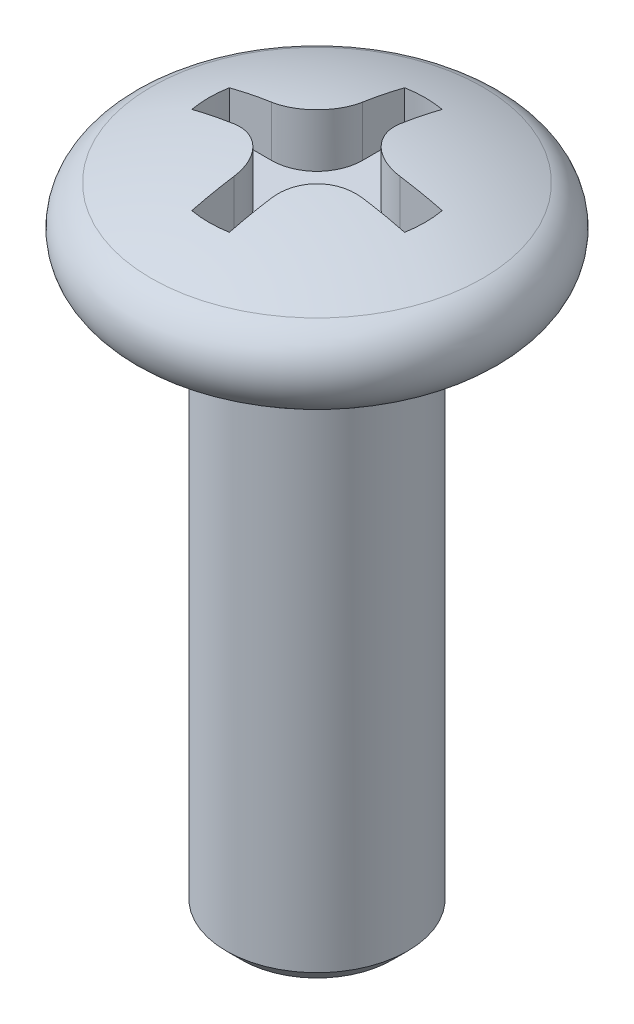
ISO-10303-21;
HEADER;
FILE_DESCRIPTION(('STEP AP214'),'2;1');
FILE_NAME('part.step','',(''),(''),'','','');
FILE_SCHEMA(('AUTOMOTIVE_DESIGN { 1 0 10303 214 1 1 1 1 }'));
ENDSEC;
DATA;
#1=APPLICATION_CONTEXT('core data for automotive mechanical design processes');
#2=APPLICATION_PROTOCOL_DEFINITION('international standard','automotive_design',2000,#1);
#3=PRODUCT_CONTEXT('',#1,'mechanical');
#4=PRODUCT('Part','Part','',(#3));
#5=PRODUCT_RELATED_PRODUCT_CATEGORY('part','',(#4));
#6=PRODUCT_DEFINITION_FORMATION('','',#4);
#7=PRODUCT_DEFINITION_CONTEXT('part definition',#1,'design');
#8=PRODUCT_DEFINITION('design','',#6,#7);
#9=PRODUCT_DEFINITION_SHAPE('','',#8);
#10=(LENGTH_UNIT() NAMED_UNIT(*) SI_UNIT(.MILLI.,.METRE.));
#11=(NAMED_UNIT(*) PLANE_ANGLE_UNIT() SI_UNIT($,.RADIAN.));
#12=(NAMED_UNIT(*) SI_UNIT($,.STERADIAN.) SOLID_ANGLE_UNIT());
#13=UNCERTAINTY_MEASURE_WITH_UNIT(LENGTH_MEASURE(1.E-05),#10,'distance_accuracy_value','');
#14=(GEOMETRIC_REPRESENTATION_CONTEXT(3) GLOBAL_UNCERTAINTY_ASSIGNED_CONTEXT((#13)) GLOBAL_UNIT_ASSIGNED_CONTEXT((#10,
#11,#12)) REPRESENTATION_CONTEXT('',''));
#15=CARTESIAN_POINT('',(0.,0.,0.));
#16=DIRECTION('',(0.,0.,1.));
#17=DIRECTION('',(1.,0.,0.));
#18=AXIS2_PLACEMENT_3D('',#15,#16,#17);
#19=CARTESIAN_POINT('',(0.,0.8,0.));
#20=DIRECTION('',(0.,-1.,0.));
#21=DIRECTION('',(0.,0.,-1.));
#22=AXIS2_PLACEMENT_3D('',#19,#20,#21);
#23=PLANE('',#22);
#24=DIRECTION('',(0.,0.,1.));
#25=VECTOR('',#24,1.);
#26=CARTESIAN_POINT('',(-0.2692388155425,0.8,1.526437178598));
#27=LINE('',#26,#25);
#28=CARTESIAN_POINT('',(-0.2692388155425,0.8,0.9192388155425));
#29=VERTEX_POINT('',#28);
#30=CARTESIAN_POINT('',(-0.2692388155425,0.8,1.52643717859784));
#31=VERTEX_POINT('',#30);
#32=EDGE_CURVE('E159',#29,#31,#27,.T.);
#33=ORIENTED_EDGE('',*,*,#32,.T.);
#34=CARTESIAN_POINT('',(0.,0.8,0.));
#35=DIRECTION('',(0.,-1.,0.));
#36=DIRECTION('',(0.,0.,-1.));
#37=AXIS2_PLACEMENT_3D('',#34,#35,#36);
#38=CIRCLE('',#37,1.55);
#39=CARTESIAN_POINT('',(0.269238815542473,0.8,1.52643717859769));
#40=VERTEX_POINT('',#39);
#41=EDGE_CURVE('E231',#31,#40,#38,.F.);
#42=ORIENTED_EDGE('',*,*,#41,.T.);
#43=DIRECTION('',(0.,0.,-1.));
#44=VECTOR('',#43,1.);
#45=CARTESIAN_POINT('',(0.2692388155425,0.8,0.9192388155425));
#46=LINE('',#45,#44);
#47=CARTESIAN_POINT('',(0.2692388155425,0.8,0.9192388155425));
#48=VERTEX_POINT('',#47);
#49=EDGE_CURVE('E163',#40,#48,#46,.T.);
#50=ORIENTED_EDGE('',*,*,#49,.T.);
#51=CARTESIAN_POINT('',(0.9192388155425,0.8,0.9192388155425));
#52=DIRECTION('',(0.,-1.,0.));
#53=DIRECTION('',(0.,0.,-1.));
#54=AXIS2_PLACEMENT_3D('',#51,#52,#53);
#55=CIRCLE('',#54,0.65);
#56=CARTESIAN_POINT('',(0.9192388155425,0.8,0.2692388155425));
#57=VERTEX_POINT('',#56);
#58=EDGE_CURVE('E166',#57,#48,#55,.F.);
#59=ORIENTED_EDGE('',*,*,#58,.F.);
#60=DIRECTION('',(1.,0.,0.));
#61=VECTOR('',#60,1.);
#62=CARTESIAN_POINT('',(1.526437178598,0.8,0.2692388155425));
#63=LINE('',#62,#61);
#64=CARTESIAN_POINT('',(1.52643717859784,0.8,0.2692388155425));
#65=VERTEX_POINT('',#64);
#66=EDGE_CURVE('E167',#57,#65,#63,.T.);
#67=ORIENTED_EDGE('',*,*,#66,.T.);
#68=CARTESIAN_POINT('',(0.,0.8,0.));
#69=DIRECTION('',(0.,-1.,0.));
#70=DIRECTION('',(0.,0.,-1.));
#71=AXIS2_PLACEMENT_3D('',#68,#69,#70);
#72=CIRCLE('',#71,1.55);
#73=CARTESIAN_POINT('',(1.52643717859769,0.8,-0.269238815542473));
#74=VERTEX_POINT('',#73);
#75=EDGE_CURVE('E242',#65,#74,#72,.F.);
#76=ORIENTED_EDGE('',*,*,#75,.T.);
#77=DIRECTION('',(-1.,0.,0.));
#78=VECTOR('',#77,1.);
#79=CARTESIAN_POINT('',(0.9192388155425,0.8,-0.2692388155425));
#80=LINE('',#79,#78);
#81=CARTESIAN_POINT('',(0.9192388155425,0.8,-0.2692388155425));
#82=VERTEX_POINT('',#81);
#83=EDGE_CURVE('E171',#74,#82,#80,.T.);
#84=ORIENTED_EDGE('',*,*,#83,.T.);
#85=CARTESIAN_POINT('',(0.9192388155425,0.8,-0.9192388155425));
#86=DIRECTION('',(0.,-1.,0.));
#87=DIRECTION('',(0.,0.,-1.));
#88=AXIS2_PLACEMENT_3D('',#85,#86,#87);
#89=CIRCLE('',#88,0.65);
#90=CARTESIAN_POINT('',(0.2692388155425,0.8,-0.9192388155425));
#91=VERTEX_POINT('',#90);
#92=EDGE_CURVE('E174',#91,#82,#89,.F.);
#93=ORIENTED_EDGE('',*,*,#92,.F.);
#94=DIRECTION('',(0.,0.,-1.));
#95=VECTOR('',#94,1.);
#96=CARTESIAN_POINT('',(0.2692388155425,0.8,-1.526437178598));
#97=LINE('',#96,#95);
#98=CARTESIAN_POINT('',(0.2692388155425,0.8,-1.52643717859784));
#99=VERTEX_POINT('',#98);
#100=EDGE_CURVE('E176',#91,#99,#97,.T.);
#101=ORIENTED_EDGE('',*,*,#100,.T.);
#102=CARTESIAN_POINT('',(0.,0.8,0.));
#103=DIRECTION('',(0.,-1.,0.));
#104=DIRECTION('',(0.,0.,-1.));
#105=AXIS2_PLACEMENT_3D('',#102,#103,#104);
#106=CIRCLE('',#105,1.55);
#107=CARTESIAN_POINT('',(-0.269238815542474,0.8,-1.52643717859769));
#108=VERTEX_POINT('',#107);
#109=EDGE_CURVE('E135',#99,#108,#106,.F.);
#110=ORIENTED_EDGE('',*,*,#109,.T.);
#111=DIRECTION('',(0.,0.,1.));
#112=VECTOR('',#111,1.);
#113=CARTESIAN_POINT('',(-0.2692388155425,0.8,-0.9192388155425));
#114=LINE('',#113,#112);
#115=CARTESIAN_POINT('',(-0.2692388155425,0.8,-0.9192388155425));
#116=VERTEX_POINT('',#115);
#117=EDGE_CURVE('E131',#108,#116,#114,.T.);
#118=ORIENTED_EDGE('',*,*,#117,.T.);
#119=CARTESIAN_POINT('',(-0.9192388155425,0.8,-0.9192388155425));
#120=DIRECTION('',(0.,-1.,0.));
#121=DIRECTION('',(0.,0.,-1.));
#122=AXIS2_PLACEMENT_3D('',#119,#120,#121);
#123=CIRCLE('',#122,0.65);
#124=CARTESIAN_POINT('',(-0.9192388155425,0.8,-0.2692388155425));
#125=VERTEX_POINT('',#124);
#126=EDGE_CURVE('E19',#125,#116,#123,.F.);
#127=ORIENTED_EDGE('',*,*,#126,.F.);
#128=DIRECTION('',(-1.,0.,0.));
#129=VECTOR('',#128,1.);
#130=CARTESIAN_POINT('',(-1.526437178598,0.8,-0.2692388155425));
#131=LINE('',#130,#129);
#132=CARTESIAN_POINT('',(-1.52643717859769,0.8,-0.269238815542473));
#133=VERTEX_POINT('',#132);
#134=EDGE_CURVE('E126',#125,#133,#131,.T.);
#135=ORIENTED_EDGE('',*,*,#134,.T.);
#136=CARTESIAN_POINT('',(0.,0.8,0.));
#137=DIRECTION('',(0.,-1.,0.));
#138=DIRECTION('',(0.,0.,-1.));
#139=AXIS2_PLACEMENT_3D('',#136,#137,#138);
#140=CIRCLE('',#139,1.55);
#141=CARTESIAN_POINT('',(-1.52643717859784,0.8,0.2692388155425));
#142=VERTEX_POINT('',#141);
#143=EDGE_CURVE('E239',#133,#142,#140,.F.);
#144=ORIENTED_EDGE('',*,*,#143,.T.);
#145=DIRECTION('',(1.,0.,0.));
#146=VECTOR('',#145,1.);
#147=CARTESIAN_POINT('',(-0.9192388155425,0.8,0.2692388155425));
#148=LINE('',#147,#146);
#149=CARTESIAN_POINT('',(-0.9192388155425,0.8,0.2692388155425));
#150=VERTEX_POINT('',#149);
#151=EDGE_CURVE('E156',#142,#150,#148,.T.);
#152=ORIENTED_EDGE('',*,*,#151,.T.);
#153=CARTESIAN_POINT('',(-0.9192388155425,0.8,0.9192388155425));
#154=DIRECTION('',(0.,-1.,0.));
#155=DIRECTION('',(0.,0.,-1.));
#156=AXIS2_PLACEMENT_3D('',#153,#154,#155);
#157=CIRCLE('',#156,0.65);
#158=EDGE_CURVE('E225',#29,#150,#157,.F.);
#159=ORIENTED_EDGE('',*,*,#158,.F.);
#160=EDGE_LOOP('',(#33,#42,#50,#59,#67,#76,#84,#93,#101,#110,#118,#127,#135,#144,#152,#159));
#161=FACE_BOUND('',#160,.T.);
#162=ADVANCED_FACE('F16',(#161),#23,.F.);
#163=CARTESIAN_POINT('',(-1.526437178598,0.8,-0.2692388155425));
#164=DIRECTION('',(0.,0.,-1.));
#165=DIRECTION('',(-1.,0.,0.));
#166=AXIS2_PLACEMENT_3D('',#163,#164,#165);
#167=PLANE('',#166);
#168=ORIENTED_EDGE('',*,*,#134,.F.);
#169=DIRECTION('',(0.,-1.,0.));
#170=VECTOR('',#169,1.);
#171=CARTESIAN_POINT('',(-0.9192388155425,0.8,-0.2692388155425));
#172=LINE('',#171,#170);
#173=CARTESIAN_POINT('',(-0.919238815542485,1.5247137721749,-0.269238815542501));
#174=VERTEX_POINT('',#173);
#175=EDGE_CURVE('E145',#174,#125,#172,.T.);
#176=ORIENTED_EDGE('',*,*,#175,.F.);
#177=CARTESIAN_POINT('',(-1.52643717859784,1.40083405534686,-0.269238815542502));
#178=CARTESIAN_POINT('',(-1.42628258533272,1.42660341497324,-0.269238815542501));
#179=CARTESIAN_POINT('',(-1.3256054251122,1.44981140452209,-0.2692388155425));
#180=CARTESIAN_POINT('',(-1.12320597076041,1.49110464346474,-0.2692388155425));
#181=CARTESIAN_POINT('',(-1.02148367662913,1.50918989285854,-0.269238815542501));
#182=CARTESIAN_POINT('',(-0.919238815542471,1.52471377217481,-0.269238815542503));
#183=B_SPLINE_CURVE_WITH_KNOTS('',3,(#177,#178,#179,#180,#181,#182),.UNSPECIFIED.,.F.,.F.,(4,2,
4),(0.,0.309952435577939,0.619904871155877),.UNSPECIFIED.);
#184=CARTESIAN_POINT('',(-1.52643717859777,1.40083405534693,-0.269238815542474));
#185=VERTEX_POINT('',#184);
#186=EDGE_CURVE('E222',#185,#174,#183,.T.);
#187=ORIENTED_EDGE('',*,*,#186,.F.);
#188=DIRECTION('',(0.,-1.,0.));
#189=VECTOR('',#188,1.);
#190=CARTESIAN_POINT('',(-1.5264371785977,0.8,-0.269238815542447));
#191=LINE('',#190,#189);
#192=EDGE_CURVE('E237',#185,#133,#191,.T.);
#193=ORIENTED_EDGE('',*,*,#192,.T.);
#194=EDGE_LOOP('',(#168,#176,#187,#193));
#195=FACE_BOUND('',#194,.T.);
#196=ADVANCED_FACE('F280',(#195),#167,.F.);
#197=CARTESIAN_POINT('',(-0.9192388155425,0.8,-0.9192388155425));
#198=DIRECTION('',(0.,-1.,0.));
#199=DIRECTION('',(0.,0.,-1.));
#200=AXIS2_PLACEMENT_3D('',#197,#198,#199);
#201=CYLINDRICAL_SURFACE('',#200,0.65);
#202=DIRECTION('',(0.,1.,0.));
#203=VECTOR('',#202,1.);
#204=CARTESIAN_POINT('',(-0.2692388155425,0.8,-0.9192388155425));
#205=LINE('',#204,#203);
#206=CARTESIAN_POINT('',(-0.269238815542499,1.5247137721749,-0.9192388155425));
#207=VERTEX_POINT('',#206);
#208=EDGE_CURVE('E139',#116,#207,#205,.T.);
#209=ORIENTED_EDGE('',*,*,#208,.T.);
#210=CARTESIAN_POINT('',(-0.919238815542471,1.52471377217481,-0.269238815542502));
#211=CARTESIAN_POINT('',(-0.883271069284547,1.53017838215662,-0.269206596368221));
#212=CARTESIAN_POINT('',(-0.847230957030022,1.53518398680924,-0.272222835690411));
#213=CARTESIAN_POINT('',(-0.776024482266567,1.54415362187526,-0.284194183766013));
#214=CARTESIAN_POINT('',(-0.740857976412674,1.5481178242021,-0.293148311438722));
#215=CARTESIAN_POINT('',(-0.67237147630745,1.55488625546089,-0.316848960302737));
#216=CARTESIAN_POINT('',(-0.639053304502208,1.55768935656103,-0.331601086387425));
#217=CARTESIAN_POINT('',(-0.575297778798748,1.56204492956572,-0.366496760027211));
#218=CARTESIAN_POINT('',(-0.544859240050173,1.56359791783258,-0.386638076978003));
#219=CARTESIAN_POINT('',(-0.488097063461274,1.56539571440067,-0.431479043245953));
#220=CARTESIAN_POINT('',(-0.46172860298219,1.56565593228317,-0.456121349806758));
#221=CARTESIAN_POINT('',(-0.413435525795813,1.56490196217992,-0.509414647326526));
#222=CARTESIAN_POINT('',(-0.391510799474461,1.56388780563375,-0.538065539375813));
#223=CARTESIAN_POINT('',(-0.352825154531402,1.56062536432746,-0.598376464130783));
#224=CARTESIAN_POINT('',(-0.33603703253758,1.55838376285363,-0.630019440211363));
#225=CARTESIAN_POINT('',(-0.307904881496572,1.55273696196925,-0.69554063304805));
#226=CARTESIAN_POINT('',(-0.296559537832556,1.54933204387991,-0.729418307797173));
#227=CARTESIAN_POINT('',(-0.281799832125994,1.54249219211062,-0.789390970708275));
#228=CARTESIAN_POINT('',(-0.277087023520738,1.53929822937966,-0.815202930682549));
#229=CARTESIAN_POINT('',(-0.270805742102409,1.53238664939424,-0.867099473917435));
#230=CARTESIAN_POINT('',(-0.269232761212042,1.52866979112439,-0.893183612184108));
#231=CARTESIAN_POINT('',(-0.269238815542499,1.5247137721748,-0.919238815542471));
#232=B_SPLINE_CURVE_WITH_KNOTS('',3,(#210,#211,#212,#213,#214,#215,#216,#217,#218,#219,#220,
#221,#222,#223,#224,#225,#226,#227,#228,#229,#230,#231),.UNSPECIFIED.,.F.,.F.,(4,2,2,2,2,2,2,2,
2,2,4),(0.,0.109017930799935,0.218017853725243,0.327123406477721,0.436183869743588,
0.543941180487167,0.651695832846214,0.758869525629321,0.866017319256542,0.945129051904781,
1.02412711619082),.UNSPECIFIED.);
#233=EDGE_CURVE('E264',#174,#207,#232,.T.);
#234=ORIENTED_EDGE('',*,*,#233,.F.);
#235=ORIENTED_EDGE('',*,*,#175,.T.);
#236=ORIENTED_EDGE('',*,*,#126,.T.);
#237=EDGE_LOOP('',(#209,#234,#235,#236));
#238=FACE_BOUND('',#237,.T.);
#239=ADVANCED_FACE('F142',(#238),#201,.T.);
#240=CARTESIAN_POINT('',(-0.2692388155425,0.8,-0.9192388155425));
#241=DIRECTION('',(-1.,0.,0.));
#242=DIRECTION('',(0.,0.,1.));
#243=AXIS2_PLACEMENT_3D('',#240,#241,#242);
#244=PLANE('',#243);
#245=ORIENTED_EDGE('',*,*,#117,.F.);
#246=DIRECTION('',(0.,-1.,0.));
#247=VECTOR('',#246,1.);
#248=CARTESIAN_POINT('',(-0.269238815542447,0.8,-1.5264371785977));
#249=LINE('',#248,#247);
#250=CARTESIAN_POINT('',(-0.269238815542499,1.40083405534695,-1.5264371785976));
#251=VERTEX_POINT('',#250);
#252=EDGE_CURVE('E151',#108,#251,#249,.F.);
#253=ORIENTED_EDGE('',*,*,#252,.T.);
#254=CARTESIAN_POINT('',(-0.269238815542499,-4.530985590341,0.));
#255=DIRECTION('',(-1.,0.,0.));
#256=DIRECTION('',(0.,0.,1.));
#257=AXIS2_PLACEMENT_3D('',#254,#255,#256);
#258=CIRCLE('',#257,6.12507100115372);
#259=EDGE_CURVE('E148',#207,#251,#258,.T.);
#260=ORIENTED_EDGE('',*,*,#259,.F.);
#261=ORIENTED_EDGE('',*,*,#208,.F.);
#262=EDGE_LOOP('',(#245,#253,#260,#261));
#263=FACE_BOUND('',#262,.T.);
#264=ADVANCED_FACE('F146',(#263),#244,.F.);
#265=CARTESIAN_POINT('',(0.,0.8,0.));
#266=DIRECTION('',(0.,-1.,0.));
#267=DIRECTION('',(0.,0.,-1.));
#268=AXIS2_PLACEMENT_3D('',#265,#266,#267);
#269=CYLINDRICAL_SURFACE('',#268,1.55);
#270=ORIENTED_EDGE('',*,*,#109,.F.);
#271=DIRECTION('',(0.,1.,0.));
#272=VECTOR('',#271,1.);
#273=CARTESIAN_POINT('',(0.2692388155425,0.8,-1.526437178598));
#274=LINE('',#273,#272);
#275=CARTESIAN_POINT('',(0.2692388155425,1.40083405534691,-1.52643717859775));
#276=VERTEX_POINT('',#275);
#277=EDGE_CURVE('E177',#99,#276,#274,.T.);
#278=ORIENTED_EDGE('',*,*,#277,.T.);
#279=CARTESIAN_POINT('',(0.,1.400834055347,0.));
#280=DIRECTION('',(0.,-1.,0.));
#281=DIRECTION('',(0.,0.,-1.));
#282=AXIS2_PLACEMENT_3D('',#279,#280,#281);
#283=CIRCLE('',#282,1.55);
#284=EDGE_CURVE('E252',#251,#276,#283,.T.);
#285=ORIENTED_EDGE('',*,*,#284,.F.);
#286=ORIENTED_EDGE('',*,*,#252,.F.);
#287=EDGE_LOOP('',(#270,#278,#285,#286));
#288=FACE_BOUND('',#287,.T.);
#289=ADVANCED_FACE('F250',(#288),#269,.F.);
#290=CARTESIAN_POINT('',(0.2692388155425,0.8,-1.526437178598));
#291=DIRECTION('',(1.,0.,0.));
#292=DIRECTION('',(0.,0.,-1.));
#293=AXIS2_PLACEMENT_3D('',#290,#291,#292);
#294=PLANE('',#293);
#295=ORIENTED_EDGE('',*,*,#100,.F.);
#296=DIRECTION('',(0.,-1.,0.));
#297=VECTOR('',#296,1.);
#298=CARTESIAN_POINT('',(0.2692388155425,0.8,-0.9192388155425));
#299=LINE('',#298,#297);
#300=CARTESIAN_POINT('',(0.2692388155425,1.5247137721749,-0.9192388155425));
#301=VERTEX_POINT('',#300);
#302=EDGE_CURVE('E244',#301,#91,#299,.T.);
#303=ORIENTED_EDGE('',*,*,#302,.F.);
#304=CARTESIAN_POINT('',(0.2692388155425,-4.530985590341,0.));
#305=DIRECTION('',(-1.,0.,0.));
#306=DIRECTION('',(0.,0.,1.));
#307=AXIS2_PLACEMENT_3D('',#304,#305,#306);
#308=CIRCLE('',#307,6.12507100115372);
#309=EDGE_CURVE('E255',#276,#301,#308,.F.);
#310=ORIENTED_EDGE('',*,*,#309,.F.);
#311=ORIENTED_EDGE('',*,*,#277,.F.);
#312=EDGE_LOOP('',(#295,#303,#310,#311));
#313=FACE_BOUND('',#312,.T.);
#314=ADVANCED_FACE('F256',(#313),#294,.F.);
#315=CARTESIAN_POINT('',(0.9192388155425,0.8,-0.9192388155425));
#316=DIRECTION('',(0.,-1.,0.));
#317=DIRECTION('',(0.,0.,-1.));
#318=AXIS2_PLACEMENT_3D('',#315,#316,#317);
#319=CYLINDRICAL_SURFACE('',#318,0.65);
#320=DIRECTION('',(0.,1.,0.));
#321=VECTOR('',#320,1.);
#322=CARTESIAN_POINT('',(0.9192388155425,0.8,-0.2692388155425));
#323=LINE('',#322,#321);
#324=CARTESIAN_POINT('',(0.919238815542485,1.5247137721749,-0.269238815542501));
#325=VERTEX_POINT('',#324);
#326=EDGE_CURVE('E173',#82,#325,#323,.T.);
#327=ORIENTED_EDGE('',*,*,#326,.T.);
#328=CARTESIAN_POINT('',(0.2692388155425,1.5247137721748,-0.919238815542471));
#329=CARTESIAN_POINT('',(0.26920659636822,1.53017838215662,-0.883271069284549));
#330=CARTESIAN_POINT('',(0.27222283569041,1.53518398680924,-0.847230957030025));
#331=CARTESIAN_POINT('',(0.284194183766012,1.54415362187526,-0.776024482266574));
#332=CARTESIAN_POINT('',(0.29314831143872,1.5481178242021,-0.740857976412682));
#333=CARTESIAN_POINT('',(0.316848960302734,1.55488625546089,-0.672371476307461));
#334=CARTESIAN_POINT('',(0.33160108638742,1.55768935656103,-0.63905330450222));
#335=CARTESIAN_POINT('',(0.366496760027202,1.56204492956572,-0.575297778798761));
#336=CARTESIAN_POINT('',(0.386638076977991,1.56359791783258,-0.544859240050187));
#337=CARTESIAN_POINT('',(0.431479043245938,1.56539571440067,-0.488097063461288));
#338=CARTESIAN_POINT('',(0.456121349806743,1.56565593228317,-0.461728602982204));
#339=CARTESIAN_POINT('',(0.509414647326511,1.56490196217992,-0.413435525795826));
#340=CARTESIAN_POINT('',(0.538065539375799,1.56388780563376,-0.391510799474473));
#341=CARTESIAN_POINT('',(0.598376464130768,1.56062536432746,-0.352825154531412));
#342=CARTESIAN_POINT('',(0.630019440211347,1.55838376285363,-0.336037032537589));
#343=CARTESIAN_POINT('',(0.695540633048032,1.55273696196925,-0.307904881496577));
#344=CARTESIAN_POINT('',(0.729418307797154,1.54933204387992,-0.296559537832559));
#345=CARTESIAN_POINT('',(0.789390970708259,1.54249219211062,-0.281799832125995));
#346=CARTESIAN_POINT('',(0.815202930682536,1.53929822937967,-0.277087023520739));
#347=CARTESIAN_POINT('',(0.867099473917428,1.53238664939424,-0.270805742102411));
#348=CARTESIAN_POINT('',(0.893183612184104,1.52866979112439,-0.269232761212043));
#349=CARTESIAN_POINT('',(0.91923881554247,1.52471377217481,-0.269238815542501));
#350=B_SPLINE_CURVE_WITH_KNOTS('',3,(#328,#329,#330,#331,#332,#333,#334,#335,#336,#337,#338,
#339,#340,#341,#342,#343,#344,#345,#346,#347,#348,#349),.UNSPECIFIED.,.F.,.F.,(4,2,2,2,2,2,2,2,
2,2,4),(0.,0.10901793079993,0.218017853725233,0.327123406477707,0.436183869743568,
0.543941180487147,0.651695832846195,0.758869525629303,0.866017319256523,0.945129051904771,
1.02412711619082),.UNSPECIFIED.);
#351=EDGE_CURVE('E260',#301,#325,#350,.T.);
#352=ORIENTED_EDGE('',*,*,#351,.F.);
#353=ORIENTED_EDGE('',*,*,#302,.T.);
#354=ORIENTED_EDGE('',*,*,#92,.T.);
#355=EDGE_LOOP('',(#327,#352,#353,#354));
#356=FACE_BOUND('',#355,.T.);
#357=ADVANCED_FACE('F410',(#356),#319,.T.);
#358=CARTESIAN_POINT('',(0.9192388155425,0.8,-0.2692388155425));
#359=DIRECTION('',(0.,0.,-1.));
#360=DIRECTION('',(-1.,0.,0.));
#361=AXIS2_PLACEMENT_3D('',#358,#359,#360);
#362=PLANE('',#361);
#363=ORIENTED_EDGE('',*,*,#83,.F.);
#364=DIRECTION('',(0.,-1.,0.));
#365=VECTOR('',#364,1.);
#366=CARTESIAN_POINT('',(1.5264371785977,0.8,-0.269238815542447));
#367=LINE('',#366,#365);
#368=CARTESIAN_POINT('',(1.52643717859769,1.400834055347,-0.269238815542473));
#369=VERTEX_POINT('',#368);
#370=EDGE_CURVE('E170',#74,#369,#367,.F.);
#371=ORIENTED_EDGE('',*,*,#370,.T.);
#372=CARTESIAN_POINT('',(0.91923881554247,1.52471377217481,-0.269238815542502));
#373=CARTESIAN_POINT('',(1.02148367662913,1.50918989285854,-0.269238815542501));
#374=CARTESIAN_POINT('',(1.12320597076041,1.49110464346474,-0.2692388155425));
#375=CARTESIAN_POINT('',(1.3256054251122,1.44981140452209,-0.2692388155425));
#376=CARTESIAN_POINT('',(1.42628258533272,1.42660341497324,-0.269238815542501));
#377=CARTESIAN_POINT('',(1.52643717859784,1.40083405534686,-0.269238815542503));
#378=B_SPLINE_CURVE_WITH_KNOTS('',3,(#372,#373,#374,#375,#376,#377),.UNSPECIFIED.,.F.,.F.,(4,2,
4),(0.,0.309952435577939,0.619904871155879),.UNSPECIFIED.);
#379=EDGE_CURVE('E643',#325,#369,#378,.T.);
#380=ORIENTED_EDGE('',*,*,#379,.F.);
#381=ORIENTED_EDGE('',*,*,#326,.F.);
#382=EDGE_LOOP('',(#363,#371,#380,#381));
#383=FACE_BOUND('',#382,.T.);
#384=ADVANCED_FACE('F401',(#383),#362,.F.);
#385=CARTESIAN_POINT('',(0.,0.8,0.));
#386=DIRECTION('',(0.,-1.,0.));
#387=DIRECTION('',(0.,0.,-1.));
#388=AXIS2_PLACEMENT_3D('',#385,#386,#387);
#389=CYLINDRICAL_SURFACE('',#388,1.55);
#390=ORIENTED_EDGE('',*,*,#143,.F.);
#391=ORIENTED_EDGE('',*,*,#192,.F.);
#392=CARTESIAN_POINT('',(0.,1.400834055347,0.));
#393=DIRECTION('',(0.,-1.,0.));
#394=DIRECTION('',(0.,0.,-1.));
#395=AXIS2_PLACEMENT_3D('',#392,#393,#394);
#396=CIRCLE('',#395,1.55);
#397=CARTESIAN_POINT('',(-1.52643717859784,1.400834055347,0.2692388155425));
#398=VERTEX_POINT('',#397);
#399=EDGE_CURVE('E649',#398,#185,#396,.T.);
#400=ORIENTED_EDGE('',*,*,#399,.F.);
#401=DIRECTION('',(0.,1.,0.));
#402=VECTOR('',#401,1.);
#403=CARTESIAN_POINT('',(-1.526437178598,0.8,0.2692388155425));
#404=LINE('',#403,#402);
#405=EDGE_CURVE('E158',#398,#142,#404,.F.);
#406=ORIENTED_EDGE('',*,*,#405,.T.);
#407=EDGE_LOOP('',(#390,#391,#400,#406));
#408=FACE_BOUND('',#407,.T.);
#409=ADVANCED_FACE('F392',(#408),#389,.F.);
#410=CARTESIAN_POINT('',(0.,0.8,0.));
#411=DIRECTION('',(0.,-1.,0.));
#412=DIRECTION('',(0.,0.,-1.));
#413=AXIS2_PLACEMENT_3D('',#410,#411,#412);
#414=CYLINDRICAL_SURFACE('',#413,1.55);
#415=ORIENTED_EDGE('',*,*,#370,.F.);
#416=ORIENTED_EDGE('',*,*,#75,.F.);
#417=DIRECTION('',(0.,1.,0.));
#418=VECTOR('',#417,1.);
#419=CARTESIAN_POINT('',(1.526437178598,0.8,0.2692388155425));
#420=LINE('',#419,#418);
#421=CARTESIAN_POINT('',(1.52643717859795,1.40083405534692,0.269238815542498));
#422=VERTEX_POINT('',#421);
#423=EDGE_CURVE('E169',#65,#422,#420,.T.);
#424=ORIENTED_EDGE('',*,*,#423,.T.);
#425=CARTESIAN_POINT('',(0.,1.400834055347,0.));
#426=DIRECTION('',(0.,-1.,0.));
#427=DIRECTION('',(0.,0.,-1.));
#428=AXIS2_PLACEMENT_3D('',#425,#426,#427);
#429=CIRCLE('',#428,1.55);
#430=EDGE_CURVE('E651',#369,#422,#429,.T.);
#431=ORIENTED_EDGE('',*,*,#430,.F.);
#432=EDGE_LOOP('',(#415,#416,#424,#431));
#433=FACE_BOUND('',#432,.T.);
#434=ADVANCED_FACE('F383',(#433),#414,.F.);
#435=CARTESIAN_POINT('',(1.526437178598,0.8,0.2692388155425));
#436=DIRECTION('',(0.,0.,1.));
#437=DIRECTION('',(1.,0.,0.));
#438=AXIS2_PLACEMENT_3D('',#435,#436,#437);
#439=PLANE('',#438);
#440=ORIENTED_EDGE('',*,*,#66,.F.);
#441=DIRECTION('',(0.,-1.,0.));
#442=VECTOR('',#441,1.);
#443=CARTESIAN_POINT('',(0.9192388155425,0.8,0.2692388155425));
#444=LINE('',#443,#442);
#445=CARTESIAN_POINT('',(0.919238815542485,1.5247137721749,0.269238815542499));
#446=VERTEX_POINT('',#445);
#447=EDGE_CURVE('E233',#446,#57,#444,.T.);
#448=ORIENTED_EDGE('',*,*,#447,.F.);
#449=CARTESIAN_POINT('',(1.5264371785979,1.40083405534685,0.269238815542497));
#450=CARTESIAN_POINT('',(1.42628258533276,1.42660341497323,0.269238815542499));
#451=CARTESIAN_POINT('',(1.32560542511224,1.44981140452209,0.2692388155425));
#452=CARTESIAN_POINT('',(1.12320597076043,1.49110464346474,0.2692388155425));
#453=CARTESIAN_POINT('',(1.02148367662914,1.50918989285854,0.269238815542499));
#454=CARTESIAN_POINT('',(0.91923881554247,1.52471377217481,0.269238815542498));
#455=B_SPLINE_CURVE_WITH_KNOTS('',3,(#449,#450,#451,#452,#453,#454),.UNSPECIFIED.,.F.,.F.,(4,2,
4),(0.,0.309952435577969,0.619904871155937),.UNSPECIFIED.);
#456=EDGE_CURVE('E653',#422,#446,#455,.T.);
#457=ORIENTED_EDGE('',*,*,#456,.F.);
#458=ORIENTED_EDGE('',*,*,#423,.F.);
#459=EDGE_LOOP('',(#440,#448,#457,#458));
#460=FACE_BOUND('',#459,.T.);
#461=ADVANCED_FACE('F374',(#460),#439,.F.);
#462=CARTESIAN_POINT('',(0.9192388155425,0.8,0.9192388155425));
#463=DIRECTION('',(0.,-1.,0.));
#464=DIRECTION('',(0.,0.,-1.));
#465=AXIS2_PLACEMENT_3D('',#462,#463,#464);
#466=CYLINDRICAL_SURFACE('',#465,0.65);
#467=DIRECTION('',(0.,1.,0.));
#468=VECTOR('',#467,1.);
#469=CARTESIAN_POINT('',(0.2692388155425,0.8,0.9192388155425));
#470=LINE('',#469,#468);
#471=CARTESIAN_POINT('',(0.2692388155425,1.5247137721749,0.9192388155425));
#472=VERTEX_POINT('',#471);
#473=EDGE_CURVE('E165',#48,#472,#470,.T.);
#474=ORIENTED_EDGE('',*,*,#473,.T.);
#475=CARTESIAN_POINT('',(0.91923881554247,1.52471377217481,0.269238815542498));
#476=CARTESIAN_POINT('',(0.883271069284547,1.53017838215662,0.269206596368219));
#477=CARTESIAN_POINT('',(0.847230957030021,1.53518398680924,0.27222283569041));
#478=CARTESIAN_POINT('',(0.776024482266567,1.54415362187526,0.284194183766014));
#479=CARTESIAN_POINT('',(0.740857976412673,1.5481178242021,0.293148311438724));
#480=CARTESIAN_POINT('',(0.67237147630745,1.55488625546089,0.316848960302739));
#481=CARTESIAN_POINT('',(0.639053304502207,1.55768935656103,0.331601086387426));
#482=CARTESIAN_POINT('',(0.575297778798747,1.56204492956572,0.36649676002721));
#483=CARTESIAN_POINT('',(0.544859240050172,1.56359791783258,0.386638076978001));
#484=CARTESIAN_POINT('',(0.488097063461273,1.56539571440067,0.43147904324595));
#485=CARTESIAN_POINT('',(0.461728602982189,1.56565593228317,0.456121349806757));
#486=CARTESIAN_POINT('',(0.413435525795813,1.56490196217992,0.509414647326527));
#487=CARTESIAN_POINT('',(0.39151079947446,1.56388780563376,0.538065539375815));
#488=CARTESIAN_POINT('',(0.352825154531401,1.56062536432746,0.598376464130786));
#489=CARTESIAN_POINT('',(0.336037032537579,1.55838376285363,0.630019440211365));
#490=CARTESIAN_POINT('',(0.307904881496571,1.55273696196925,0.695540633048051));
#491=CARTESIAN_POINT('',(0.296559537832556,1.54933204387991,0.729418307797174));
#492=CARTESIAN_POINT('',(0.281799832125994,1.54249219211062,0.789390970708276));
#493=CARTESIAN_POINT('',(0.277087023520738,1.53929822937966,0.815202930682551));
#494=CARTESIAN_POINT('',(0.270805742102409,1.53238664939424,0.867099473917437));
#495=CARTESIAN_POINT('',(0.269232761212041,1.52866979112439,0.89318361218411));
#496=CARTESIAN_POINT('',(0.2692388155425,1.5247137721748,0.919238815542473));
#497=B_SPLINE_CURVE_WITH_KNOTS('',3,(#475,#476,#477,#478,#479,#480,#481,#482,#483,#484,#485,
#486,#487,#488,#489,#490,#491,#492,#493,#494,#495,#496),.UNSPECIFIED.,.F.,.F.,(4,2,2,2,2,2,2,2,
2,2,4),(0.,0.109017930799935,0.218017853725244,0.327123406477721,0.436183869743587,
0.543941180487167,0.651695832846216,0.758869525629322,0.866017319256542,0.945129051904782,
1.02412711619082),.UNSPECIFIED.);
#498=EDGE_CURVE('E659',#446,#472,#497,.T.);
#499=ORIENTED_EDGE('',*,*,#498,.F.);
#500=ORIENTED_EDGE('',*,*,#447,.T.);
#501=ORIENTED_EDGE('',*,*,#58,.T.);
#502=EDGE_LOOP('',(#474,#499,#500,#501));
#503=FACE_BOUND('',#502,.T.);
#504=ADVANCED_FACE('F365',(#503),#466,.T.);
#505=CARTESIAN_POINT('',(0.2692388155425,0.8,0.9192388155425));
#506=DIRECTION('',(1.,0.,0.));
#507=DIRECTION('',(0.,0.,-1.));
#508=AXIS2_PLACEMENT_3D('',#505,#506,#507);
#509=PLANE('',#508);
#510=ORIENTED_EDGE('',*,*,#49,.F.);
#511=DIRECTION('',(0.,-1.,0.));
#512=VECTOR('',#511,1.);
#513=CARTESIAN_POINT('',(0.269238815542447,0.8,1.5264371785977));
#514=LINE('',#513,#512);
#515=CARTESIAN_POINT('',(0.2692388155425,1.40083405534695,1.5264371785976));
#516=VERTEX_POINT('',#515);
#517=EDGE_CURVE('E162',#40,#516,#514,.F.);
#518=ORIENTED_EDGE('',*,*,#517,.T.);
#519=CARTESIAN_POINT('',(0.2692388155425,-4.530985590341,0.));
#520=DIRECTION('',(-1.,0.,0.));
#521=DIRECTION('',(0.,0.,1.));
#522=AXIS2_PLACEMENT_3D('',#519,#520,#521);
#523=CIRCLE('',#522,6.12507100115372);
#524=EDGE_CURVE('E668',#472,#516,#523,.F.);
#525=ORIENTED_EDGE('',*,*,#524,.F.);
#526=ORIENTED_EDGE('',*,*,#473,.F.);
#527=EDGE_LOOP('',(#510,#518,#525,#526));
#528=FACE_BOUND('',#527,.T.);
#529=ADVANCED_FACE('F356',(#528),#509,.F.);
#530=CARTESIAN_POINT('',(0.,0.8,0.));
#531=DIRECTION('',(0.,-1.,0.));
#532=DIRECTION('',(0.,0.,-1.));
#533=AXIS2_PLACEMENT_3D('',#530,#531,#532);
#534=CYLINDRICAL_SURFACE('',#533,1.55);
#535=ORIENTED_EDGE('',*,*,#41,.F.);
#536=DIRECTION('',(0.,1.,0.));
#537=VECTOR('',#536,1.);
#538=CARTESIAN_POINT('',(-0.2692388155425,0.8,1.526437178598));
#539=LINE('',#538,#537);
#540=CARTESIAN_POINT('',(-0.269238815542499,1.40083405534691,1.52643717859775));
#541=VERTEX_POINT('',#540);
#542=EDGE_CURVE('E161',#31,#541,#539,.T.);
#543=ORIENTED_EDGE('',*,*,#542,.T.);
#544=CARTESIAN_POINT('',(0.,1.400834055347,0.));
#545=DIRECTION('',(0.,-1.,0.));
#546=DIRECTION('',(0.,0.,-1.));
#547=AXIS2_PLACEMENT_3D('',#544,#545,#546);
#548=CIRCLE('',#547,1.55);
#549=EDGE_CURVE('E671',#516,#541,#548,.T.);
#550=ORIENTED_EDGE('',*,*,#549,.F.);
#551=ORIENTED_EDGE('',*,*,#517,.F.);
#552=EDGE_LOOP('',(#535,#543,#550,#551));
#553=FACE_BOUND('',#552,.T.);
#554=ADVANCED_FACE('F347',(#553),#534,.F.);
#555=CARTESIAN_POINT('',(-0.2692388155425,0.8,1.526437178598));
#556=DIRECTION('',(-1.,0.,0.));
#557=DIRECTION('',(0.,0.,1.));
#558=AXIS2_PLACEMENT_3D('',#555,#556,#557);
#559=PLANE('',#558);
#560=ORIENTED_EDGE('',*,*,#32,.F.);
#561=DIRECTION('',(0.,-1.,0.));
#562=VECTOR('',#561,1.);
#563=CARTESIAN_POINT('',(-0.2692388155425,0.8,0.9192388155425));
#564=LINE('',#563,#562);
#565=CARTESIAN_POINT('',(-0.269238815542499,1.5247137721749,0.9192388155425));
#566=VERTEX_POINT('',#565);
#567=EDGE_CURVE('E226',#566,#29,#564,.T.);
#568=ORIENTED_EDGE('',*,*,#567,.F.);
#569=CARTESIAN_POINT('',(-0.269238815542499,-4.530985590341,0.));
#570=DIRECTION('',(-1.,0.,0.));
#571=DIRECTION('',(0.,0.,1.));
#572=AXIS2_PLACEMENT_3D('',#569,#570,#571);
#573=CIRCLE('',#572,6.12507100115372);
#574=EDGE_CURVE('E673',#541,#566,#573,.T.);
#575=ORIENTED_EDGE('',*,*,#574,.F.);
#576=ORIENTED_EDGE('',*,*,#542,.F.);
#577=EDGE_LOOP('',(#560,#568,#575,#576));
#578=FACE_BOUND('',#577,.T.);
#579=ADVANCED_FACE('F340',(#578),#559,.F.);
#580=CARTESIAN_POINT('',(-0.9192388155425,0.8,0.9192388155425));
#581=DIRECTION('',(0.,-1.,0.));
#582=DIRECTION('',(0.,0.,-1.));
#583=AXIS2_PLACEMENT_3D('',#580,#581,#582);
#584=CYLINDRICAL_SURFACE('',#583,0.65);
#585=DIRECTION('',(0.,1.,0.));
#586=VECTOR('',#585,1.);
#587=CARTESIAN_POINT('',(-0.9192388155425,0.8,0.2692388155425));
#588=LINE('',#587,#586);
#589=CARTESIAN_POINT('',(-0.919238815542485,1.5247137721749,0.269238815542499));
#590=VERTEX_POINT('',#589);
#591=EDGE_CURVE('E34',#150,#590,#588,.T.);
#592=ORIENTED_EDGE('',*,*,#591,.T.);
#593=CARTESIAN_POINT('',(-0.269238815542499,1.5247137721748,0.919238815542473));
#594=CARTESIAN_POINT('',(-0.26920659636822,1.53017838215662,0.883271069284551));
#595=CARTESIAN_POINT('',(-0.27222283569041,1.53518398680924,0.847230957030028));
#596=CARTESIAN_POINT('',(-0.284194183766012,1.54415362187526,0.776024482266576));
#597=CARTESIAN_POINT('',(-0.29314831143872,1.5481178242021,0.740857976412684));
#598=CARTESIAN_POINT('',(-0.316848960302733,1.55488625546089,0.672371476307463));
#599=CARTESIAN_POINT('',(-0.331601086387419,1.55768935656103,0.639053304502222));
#600=CARTESIAN_POINT('',(-0.3664967600272,1.56204492956572,0.575297778798763));
#601=CARTESIAN_POINT('',(-0.386638076977989,1.56359791783258,0.544859240050189));
#602=CARTESIAN_POINT('',(-0.431479043245935,1.56539571440067,0.488097063461289));
#603=CARTESIAN_POINT('',(-0.45612134980674,1.56565593228317,0.461728602982205));
#604=CARTESIAN_POINT('',(-0.509414647326509,1.56490196217992,0.413435525795828));
#605=CARTESIAN_POINT('',(-0.538065539375797,1.56388780563376,0.391510799474476));
#606=CARTESIAN_POINT('',(-0.598376464130766,1.56062536432746,0.352825154531415));
#607=CARTESIAN_POINT('',(-0.630019440211344,1.55838376285363,0.33603703253759));
#608=CARTESIAN_POINT('',(-0.695540633048029,1.55273696196925,0.307904881496579));
#609=CARTESIAN_POINT('',(-0.729418307797152,1.54933204387992,0.296559537832563));
#610=CARTESIAN_POINT('',(-0.789390970708258,1.54249219211062,0.281799832125998));
#611=CARTESIAN_POINT('',(-0.815202930682535,1.53929822937967,0.27708702352074));
#612=CARTESIAN_POINT('',(-0.867099473917428,1.53238664939424,0.270805742102409));
#613=CARTESIAN_POINT('',(-0.893183612184104,1.52866979112439,0.269232761212041));
#614=CARTESIAN_POINT('',(-0.919238815542471,1.52471377217481,0.269238815542499));
#615=B_SPLINE_CURVE_WITH_KNOTS('',3,(#593,#594,#595,#596,#597,#598,#599,#600,#601,#602,#603,
#604,#605,#606,#607,#608,#609,#610,#611,#612,#613,#614),.UNSPECIFIED.,.F.,.F.,(4,2,2,2,2,2,2,2,
2,2,4),(0.,0.10901793079993,0.218017853725234,0.327123406477707,0.436183869743568,
0.543941180487147,0.651695832846194,0.758869525629302,0.866017319256523,0.945129051904773,
1.02412711619082),.UNSPECIFIED.);
#616=EDGE_CURVE('E198',#566,#590,#615,.T.);
#617=ORIENTED_EDGE('',*,*,#616,.F.);
#618=ORIENTED_EDGE('',*,*,#567,.T.);
#619=ORIENTED_EDGE('',*,*,#158,.T.);
#620=EDGE_LOOP('',(#592,#617,#618,#619));
#621=FACE_BOUND('',#620,.T.);
#622=ADVANCED_FACE('F332',(#621),#584,.T.);
#623=CARTESIAN_POINT('',(-0.9192388155425,0.8,0.2692388155425));
#624=DIRECTION('',(0.,0.,1.));
#625=DIRECTION('',(1.,0.,0.));
#626=AXIS2_PLACEMENT_3D('',#623,#624,#625);
#627=PLANE('',#626);
#628=ORIENTED_EDGE('',*,*,#151,.F.);
#629=ORIENTED_EDGE('',*,*,#405,.F.);
#630=CARTESIAN_POINT('',(-0.919238815542471,1.52471377217481,0.269238815542498));
#631=CARTESIAN_POINT('',(-1.02148367662914,1.50918989285854,0.2692388155425));
#632=CARTESIAN_POINT('',(-1.12320597076043,1.49110464346474,0.2692388155425));
#633=CARTESIAN_POINT('',(-1.32560542511224,1.44981140452209,0.2692388155425));
#634=CARTESIAN_POINT('',(-1.42628258533276,1.42660341497323,0.269238815542498));
#635=CARTESIAN_POINT('',(-1.5264371785979,1.40083405534685,0.269238815542496));
#636=B_SPLINE_CURVE_WITH_KNOTS('',3,(#630,#631,#632,#633,#634,#635),.UNSPECIFIED.,.F.,.F.,(4,2,
4),(0.,0.309952435577968,0.619904871155936),.UNSPECIFIED.);
#637=EDGE_CURVE('E190',#590,#398,#636,.T.);
#638=ORIENTED_EDGE('',*,*,#637,.F.);
#639=ORIENTED_EDGE('',*,*,#591,.F.);
#640=EDGE_LOOP('',(#628,#629,#638,#639));
#641=FACE_BOUND('',#640,.T.);
#642=ADVANCED_FACE('F204',(#641),#627,.F.);
#643=CARTESIAN_POINT('',(0.,-4.530985590341,0.));
#644=DIRECTION('',(-1.,0.,0.));
#645=DIRECTION('',(0.,0.,-1.));
#646=AXIS2_PLACEMENT_3D('',#643,#644,#645);
#647=SPHERICAL_SURFACE('',#646,6.130985590341);
#648=CARTESIAN_POINT('',(0.,1.12000000000007,0.));
#649=DIRECTION('',(0.,-1.,0.));
#650=DIRECTION('',(-1.,0.,0.));
#651=AXIS2_PLACEMENT_3D('',#648,#649,#650);
#652=CIRCLE('',#651,2.37809717352503);
#653=CARTESIAN_POINT('',(-2.37809717352503,1.12000000000007,0.));
#654=VERTEX_POINT('',#653);
#655=EDGE_CURVE('E187',#654,#654,#652,.T.);
#656=ORIENTED_EDGE('',*,*,#655,.F.);
#657=EDGE_LOOP('',(#656));
#658=FACE_BOUND('',#657,.T.);
#659=ORIENTED_EDGE('',*,*,#616,.T.);
#660=ORIENTED_EDGE('',*,*,#637,.T.);
#661=ORIENTED_EDGE('',*,*,#399,.T.);
#662=ORIENTED_EDGE('',*,*,#186,.T.);
#663=ORIENTED_EDGE('',*,*,#233,.T.);
#664=ORIENTED_EDGE('',*,*,#259,.T.);
#665=ORIENTED_EDGE('',*,*,#284,.T.);
#666=ORIENTED_EDGE('',*,*,#309,.T.);
#667=ORIENTED_EDGE('',*,*,#351,.T.);
#668=ORIENTED_EDGE('',*,*,#379,.T.);
#669=ORIENTED_EDGE('',*,*,#430,.T.);
#670=ORIENTED_EDGE('',*,*,#456,.T.);
#671=ORIENTED_EDGE('',*,*,#498,.T.);
#672=ORIENTED_EDGE('',*,*,#524,.T.);
#673=ORIENTED_EDGE('',*,*,#549,.T.);
#674=ORIENTED_EDGE('',*,*,#574,.T.);
#675=EDGE_LOOP('',(#659,#660,#661,#662,#663,#664,#665,#666,#667,#668,#669,#670,#671,#672,#673,#674));
#676=FACE_BOUND('',#675,.T.);
#677=ADVANCED_FACE('F206',(#658,#676),#647,.T.);
#678=CARTESIAN_POINT('',(0.,0.56,0.));
#679=DIRECTION('',(0.,-1.,0.));
#680=DIRECTION('',(-1.,0.,0.));
#681=AXIS2_PLACEMENT_3D('',#678,#679,#680);
#682=TOROIDAL_SURFACE('',#681,2.142433076372,0.6075669236282);
#683=CARTESIAN_POINT('',(0.,0.,0.));
#684=DIRECTION('',(0.,-1.,0.));
#685=DIRECTION('',(0.,0.,-1.));
#686=AXIS2_PLACEMENT_3D('',#683,#684,#685);
#687=CIRCLE('',#686,2.3780971735252);
#688=CARTESIAN_POINT('',(0.,0.,-2.3780971735252));
#689=VERTEX_POINT('',#688);
#690=EDGE_CURVE('E184',#689,#689,#687,.T.);
#691=ORIENTED_EDGE('',*,*,#690,.F.);
#692=EDGE_LOOP('',(#691));
#693=FACE_BOUND('',#692,.T.);
#694=ORIENTED_EDGE('',*,*,#655,.T.);
#695=EDGE_LOOP('',(#694));
#696=FACE_BOUND('',#695,.T.);
#697=ADVANCED_FACE('F211',(#693,#696),#682,.T.);
#698=CARTESIAN_POINT('',(0.,-8.,0.));
#699=DIRECTION('',(0.,-1.,0.));
#700=DIRECTION('',(0.,0.,-1.));
#701=AXIS2_PLACEMENT_3D('',#698,#699,#700);
#702=PLANE('',#701);
#703=CARTESIAN_POINT('',(0.,-7.99999999998136,0.));
#704=DIRECTION('',(0.,1.,0.));
#705=DIRECTION('',(0.,0.,1.));
#706=AXIS2_PLACEMENT_3D('',#703,#704,#705);
#707=CIRCLE('',#706,1.07500000001437);
#708=CARTESIAN_POINT('',(0.,-7.99999999998136,1.07500000001437));
#709=VERTEX_POINT('',#708);
#710=EDGE_CURVE('E181',#709,#709,#707,.T.);
#711=ORIENTED_EDGE('',*,*,#710,.F.);
#712=EDGE_LOOP('',(#711));
#713=FACE_BOUND('',#712,.T.);
#714=ADVANCED_FACE('F302',(#713),#702,.T.);
#715=CARTESIAN_POINT('',(0.,0.,0.));
#716=DIRECTION('',(0.,-1.,0.));
#717=DIRECTION('',(0.,0.,-1.));
#718=AXIS2_PLACEMENT_3D('',#715,#716,#717);
#719=PLANE('',#718);
#720=CARTESIAN_POINT('',(0.,0.,0.));
#721=DIRECTION('',(0.,-1.,0.));
#722=DIRECTION('',(0.,0.,-1.));
#723=AXIS2_PLACEMENT_3D('',#720,#721,#722);
#724=CIRCLE('',#723,1.3);
#725=CARTESIAN_POINT('',(0.,0.,-1.3));
#726=VERTEX_POINT('',#725);
#727=EDGE_CURVE('E25',#726,#726,#724,.T.);
#728=ORIENTED_EDGE('',*,*,#727,.F.);
#729=EDGE_LOOP('',(#728));
#730=FACE_BOUND('',#729,.T.);
#731=ORIENTED_EDGE('',*,*,#690,.T.);
#732=EDGE_LOOP('',(#731));
#733=FACE_BOUND('',#732,.T.);
#734=ADVANCED_FACE('F296',(#730,#733),#719,.T.);
#735=CARTESIAN_POINT('',(0.,-7.77499999998099,0.));
#736=DIRECTION('',(0.,1.,0.));
#737=DIRECTION('',(0.,0.,1.));
#738=AXIS2_PLACEMENT_3D('',#735,#736,#737);
#739=CONICAL_SURFACE('',#738,1.30000000001473,0.785398163397448);
#740=CARTESIAN_POINT('',(0.,-7.775,0.));
#741=DIRECTION('',(0.,-1.,0.));
#742=DIRECTION('',(0.,0.,-1.));
#743=AXIS2_PLACEMENT_3D('',#740,#741,#742);
#744=CIRCLE('',#743,1.3);
#745=CARTESIAN_POINT('',(0.,-7.775,-1.3));
#746=VERTEX_POINT('',#745);
#747=EDGE_CURVE('E11',#746,#746,#744,.F.);
#748=ORIENTED_EDGE('',*,*,#747,.F.);
#749=EDGE_LOOP('',(#748));
#750=FACE_BOUND('',#749,.T.);
#751=ORIENTED_EDGE('',*,*,#710,.T.);
#752=EDGE_LOOP('',(#751));
#753=FACE_BOUND('',#752,.T.);
#754=ADVANCED_FACE('F290',(#750,#753),#739,.T.);
#755=CARTESIAN_POINT('',(0.,2.08,0.));
#756=DIRECTION('',(0.,-1.,0.));
#757=DIRECTION('',(0.,0.,-1.));
#758=AXIS2_PLACEMENT_3D('',#755,#756,#757);
#759=CYLINDRICAL_SURFACE('',#758,1.3);
#760=ORIENTED_EDGE('',*,*,#727,.T.);
#761=EDGE_LOOP('',(#760));
#762=FACE_BOUND('',#761,.T.);
#763=ORIENTED_EDGE('',*,*,#747,.T.);
#764=EDGE_LOOP('',(#763));
#765=FACE_BOUND('',#764,.T.);
#766=ADVANCED_FACE('F288',(#762,#765),#759,.T.);
#767=CLOSED_SHELL('',(#162,#196,#239,#264,#289,#314,#357,#384,#409,#434,#461,#504,#529,#554,
#579,#622,#642,#677,#697,#714,#734,#754,#766));
#768=MANIFOLD_SOLID_BREP('B1',#767);
#769=ADVANCED_BREP_SHAPE_REPRESENTATION('',(#18,#768),#14);
#770=SHAPE_DEFINITION_REPRESENTATION(#9,#769);
ENDSEC;
END-ISO-10303-21;
